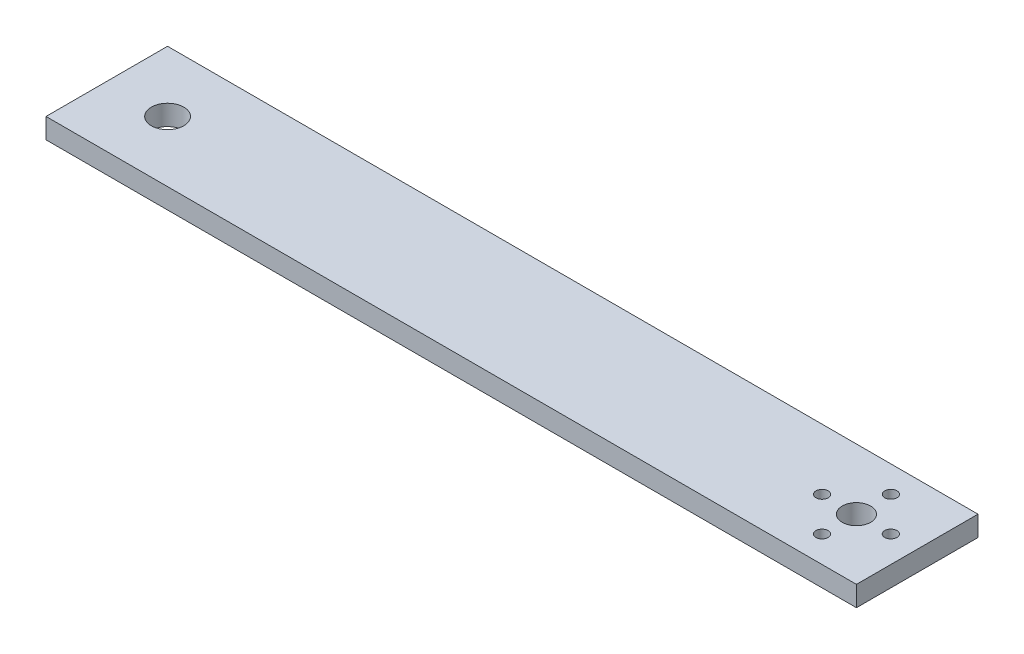
ISO-10303-21;
HEADER;
FILE_DESCRIPTION(('STEP AP214'),'2;1');
FILE_NAME('part.step','',(''),(''),'','','');
FILE_SCHEMA(('AUTOMOTIVE_DESIGN { 1 0 10303 214 1 1 1 1 }'));
ENDSEC;
DATA;
#1=APPLICATION_CONTEXT('core data for automotive mechanical design processes');
#2=APPLICATION_PROTOCOL_DEFINITION('international standard','automotive_design',2000,#1);
#3=PRODUCT_CONTEXT('',#1,'mechanical');
#4=PRODUCT('Part','Part','',(#3));
#5=PRODUCT_RELATED_PRODUCT_CATEGORY('part','',(#4));
#6=PRODUCT_DEFINITION_FORMATION('','',#4);
#7=PRODUCT_DEFINITION_CONTEXT('part definition',#1,'design');
#8=PRODUCT_DEFINITION('design','',#6,#7);
#9=PRODUCT_DEFINITION_SHAPE('','',#8);
#10=(LENGTH_UNIT() NAMED_UNIT(*) SI_UNIT(.MILLI.,.METRE.));
#11=(NAMED_UNIT(*) PLANE_ANGLE_UNIT() SI_UNIT($,.RADIAN.));
#12=(NAMED_UNIT(*) SI_UNIT($,.STERADIAN.) SOLID_ANGLE_UNIT());
#13=UNCERTAINTY_MEASURE_WITH_UNIT(LENGTH_MEASURE(1.E-05),#10,'distance_accuracy_value','');
#14=(GEOMETRIC_REPRESENTATION_CONTEXT(3) GLOBAL_UNCERTAINTY_ASSIGNED_CONTEXT((#13)) GLOBAL_UNIT_ASSIGNED_CONTEXT((#10,
#11,#12)) REPRESENTATION_CONTEXT('',''));
#15=CARTESIAN_POINT('',(0.,0.,0.));
#16=DIRECTION('',(0.,0.,1.));
#17=DIRECTION('',(1.,0.,0.));
#18=AXIS2_PLACEMENT_3D('',#15,#16,#17);
#19=CARTESIAN_POINT('',(0.,5.,0.));
#20=DIRECTION('',(1.,0.,0.));
#21=DIRECTION('',(0.,0.,-1.));
#22=AXIS2_PLACEMENT_3D('',#19,#20,#21);
#23=PLANE('',#22);
#24=DIRECTION('',(0.,0.,1.));
#25=VECTOR('',#24,1.);
#26=CARTESIAN_POINT('',(0.,0.,0.));
#27=LINE('',#26,#25);
#28=CARTESIAN_POINT('',(0.,0.,-30.));
#29=VERTEX_POINT('',#28);
#30=CARTESIAN_POINT('',(0.,0.,0.));
#31=VERTEX_POINT('',#30);
#32=EDGE_CURVE('E94',#29,#31,#27,.T.);
#33=ORIENTED_EDGE('',*,*,#32,.T.);
#34=DIRECTION('',(0.,-1.,0.));
#35=VECTOR('',#34,1.);
#36=CARTESIAN_POINT('',(0.,5.,0.));
#37=LINE('',#36,#35);
#38=CARTESIAN_POINT('',(0.,5.,0.));
#39=VERTEX_POINT('',#38);
#40=EDGE_CURVE('E11',#39,#31,#37,.T.);
#41=ORIENTED_EDGE('',*,*,#40,.F.);
#42=DIRECTION('',(0.,0.,1.));
#43=VECTOR('',#42,1.);
#44=CARTESIAN_POINT('',(0.,5.,0.));
#45=LINE('',#44,#43);
#46=CARTESIAN_POINT('',(0.,5.,-30.));
#47=VERTEX_POINT('',#46);
#48=EDGE_CURVE('E82',#47,#39,#45,.T.);
#49=ORIENTED_EDGE('',*,*,#48,.F.);
#50=DIRECTION('',(0.,-1.,0.));
#51=VECTOR('',#50,1.);
#52=CARTESIAN_POINT('',(0.,5.,-30.));
#53=LINE('',#52,#51);
#54=EDGE_CURVE('E90',#47,#29,#53,.T.);
#55=ORIENTED_EDGE('',*,*,#54,.T.);
#56=EDGE_LOOP('',(#33,#41,#49,#55));
#57=FACE_BOUND('',#56,.T.);
#58=ADVANCED_FACE('F31',(#57),#23,.F.);
#59=CARTESIAN_POINT('',(0.,5.,0.));
#60=DIRECTION('',(0.,0.,-1.));
#61=DIRECTION('',(-1.,0.,0.));
#62=AXIS2_PLACEMENT_3D('',#59,#60,#61);
#63=PLANE('',#62);
#64=DIRECTION('',(1.,0.,0.));
#65=VECTOR('',#64,1.);
#66=CARTESIAN_POINT('',(0.,0.,0.));
#67=LINE('',#66,#65);
#68=CARTESIAN_POINT('',(200.,0.,0.));
#69=VERTEX_POINT('',#68);
#70=EDGE_CURVE('E86',#31,#69,#67,.T.);
#71=ORIENTED_EDGE('',*,*,#70,.T.);
#72=DIRECTION('',(0.,-1.,0.));
#73=VECTOR('',#72,1.);
#74=CARTESIAN_POINT('',(200.,5.,0.));
#75=LINE('',#74,#73);
#76=CARTESIAN_POINT('',(200.,5.,0.));
#77=VERTEX_POINT('',#76);
#78=EDGE_CURVE('E39',#77,#69,#75,.T.);
#79=ORIENTED_EDGE('',*,*,#78,.F.);
#80=DIRECTION('',(1.,0.,0.));
#81=VECTOR('',#80,1.);
#82=CARTESIAN_POINT('',(0.,5.,0.));
#83=LINE('',#82,#81);
#84=EDGE_CURVE('E77',#39,#77,#83,.T.);
#85=ORIENTED_EDGE('',*,*,#84,.F.);
#86=ORIENTED_EDGE('',*,*,#40,.T.);
#87=EDGE_LOOP('',(#71,#79,#85,#86));
#88=FACE_BOUND('',#87,.T.);
#89=ADVANCED_FACE('F85',(#88),#63,.F.);
#90=CARTESIAN_POINT('',(200.,5.,0.));
#91=DIRECTION('',(-1.,0.,0.));
#92=DIRECTION('',(0.,0.,1.));
#93=AXIS2_PLACEMENT_3D('',#90,#91,#92);
#94=PLANE('',#93);
#95=DIRECTION('',(0.,0.,-1.));
#96=VECTOR('',#95,1.);
#97=CARTESIAN_POINT('',(200.,0.,0.));
#98=LINE('',#97,#96);
#99=CARTESIAN_POINT('',(200.,0.,-30.));
#100=VERTEX_POINT('',#99);
#101=EDGE_CURVE('E64',#69,#100,#98,.T.);
#102=ORIENTED_EDGE('',*,*,#101,.T.);
#103=DIRECTION('',(0.,-1.,0.));
#104=VECTOR('',#103,1.);
#105=CARTESIAN_POINT('',(200.,5.,-30.));
#106=LINE('',#105,#104);
#107=CARTESIAN_POINT('',(200.,5.,-30.));
#108=VERTEX_POINT('',#107);
#109=EDGE_CURVE('E87',#108,#100,#106,.T.);
#110=ORIENTED_EDGE('',*,*,#109,.F.);
#111=DIRECTION('',(0.,0.,-1.));
#112=VECTOR('',#111,1.);
#113=CARTESIAN_POINT('',(200.,5.,0.));
#114=LINE('',#113,#112);
#115=EDGE_CURVE('E80',#77,#108,#114,.T.);
#116=ORIENTED_EDGE('',*,*,#115,.F.);
#117=ORIENTED_EDGE('',*,*,#78,.T.);
#118=EDGE_LOOP('',(#102,#110,#116,#117));
#119=FACE_BOUND('',#118,.T.);
#120=ADVANCED_FACE('F88',(#119),#94,.F.);
#121=CARTESIAN_POINT('',(0.,5.,-30.));
#122=DIRECTION('',(0.,0.,1.));
#123=DIRECTION('',(1.,0.,0.));
#124=AXIS2_PLACEMENT_3D('',#121,#122,#123);
#125=PLANE('',#124);
#126=DIRECTION('',(-1.,0.,0.));
#127=VECTOR('',#126,1.);
#128=CARTESIAN_POINT('',(0.,0.,-30.));
#129=LINE('',#128,#127);
#130=EDGE_CURVE('E70',#100,#29,#129,.T.);
#131=ORIENTED_EDGE('',*,*,#130,.T.);
#132=ORIENTED_EDGE('',*,*,#54,.F.);
#133=DIRECTION('',(-1.,0.,0.));
#134=VECTOR('',#133,1.);
#135=CARTESIAN_POINT('',(0.,5.,-30.));
#136=LINE('',#135,#134);
#137=EDGE_CURVE('E47',#108,#47,#136,.T.);
#138=ORIENTED_EDGE('',*,*,#137,.F.);
#139=ORIENTED_EDGE('',*,*,#109,.T.);
#140=EDGE_LOOP('',(#131,#132,#138,#139));
#141=FACE_BOUND('',#140,.T.);
#142=ADVANCED_FACE('F102',(#141),#125,.F.);
#143=CARTESIAN_POINT('',(0.,5.,-30.));
#144=DIRECTION('',(0.,-1.,0.));
#145=DIRECTION('',(0.,0.,-1.));
#146=AXIS2_PLACEMENT_3D('',#143,#144,#145);
#147=PLANE('',#146);
#148=CARTESIAN_POINT('',(185.,5.,-6.49999999999999));
#149=DIRECTION('',(0.,1.,0.));
#150=DIRECTION('',(0.,0.,-1.));
#151=AXIS2_PLACEMENT_3D('',#148,#149,#150);
#152=CIRCLE('',#151,1.5);
#153=CARTESIAN_POINT('',(185.,5.,-7.99999999999999));
#154=VERTEX_POINT('',#153);
#155=EDGE_CURVE('E138',#154,#154,#152,.T.);
#156=ORIENTED_EDGE('',*,*,#155,.F.);
#157=EDGE_LOOP('',(#156));
#158=FACE_BOUND('',#157,.T.);
#159=CARTESIAN_POINT('',(176.520860482877,5.,-15.));
#160=DIRECTION('',(0.,1.,0.));
#161=DIRECTION('',(0.,0.,-1.));
#162=AXIS2_PLACEMENT_3D('',#159,#160,#161);
#163=CIRCLE('',#162,1.5);
#164=CARTESIAN_POINT('',(176.520860482877,5.,-16.5));
#165=VERTEX_POINT('',#164);
#166=EDGE_CURVE('E132',#165,#165,#163,.T.);
#167=ORIENTED_EDGE('',*,*,#166,.F.);
#168=EDGE_LOOP('',(#167));
#169=FACE_BOUND('',#168,.T.);
#170=CARTESIAN_POINT('',(193.479139517123,5.,-15.));
#171=DIRECTION('',(0.,1.,0.));
#172=DIRECTION('',(0.,0.,1.));
#173=AXIS2_PLACEMENT_3D('',#170,#171,#172);
#174=CIRCLE('',#173,1.5);
#175=CARTESIAN_POINT('',(193.479139517123,5.,-13.5));
#176=VERTEX_POINT('',#175);
#177=EDGE_CURVE('E126',#176,#176,#174,.T.);
#178=ORIENTED_EDGE('',*,*,#177,.F.);
#179=EDGE_LOOP('',(#178));
#180=FACE_BOUND('',#179,.T.);
#181=CARTESIAN_POINT('',(185.,5.,-23.5));
#182=DIRECTION('',(0.,1.,0.));
#183=DIRECTION('',(0.,0.,1.));
#184=AXIS2_PLACEMENT_3D('',#181,#182,#183);
#185=CIRCLE('',#184,1.5);
#186=CARTESIAN_POINT('',(185.,5.,-22.));
#187=VERTEX_POINT('',#186);
#188=EDGE_CURVE('E120',#187,#187,#185,.T.);
#189=ORIENTED_EDGE('',*,*,#188,.F.);
#190=EDGE_LOOP('',(#189));
#191=FACE_BOUND('',#190,.T.);
#192=CARTESIAN_POINT('',(185.,5.,-15.));
#193=DIRECTION('',(0.,1.,0.));
#194=DIRECTION('',(0.,0.,1.));
#195=AXIS2_PLACEMENT_3D('',#192,#193,#194);
#196=CIRCLE('',#195,3.49999999999999);
#197=CARTESIAN_POINT('',(185.,5.,-11.5));
#198=VERTEX_POINT('',#197);
#199=EDGE_CURVE('E114',#198,#198,#196,.T.);
#200=ORIENTED_EDGE('',*,*,#199,.F.);
#201=EDGE_LOOP('',(#200));
#202=FACE_BOUND('',#201,.T.);
#203=CARTESIAN_POINT('',(15.,5.,-15.));
#204=DIRECTION('',(0.,1.,0.));
#205=DIRECTION('',(0.,0.,1.));
#206=AXIS2_PLACEMENT_3D('',#203,#204,#205);
#207=CIRCLE('',#206,4.);
#208=CARTESIAN_POINT('',(15.,5.,-11.));
#209=VERTEX_POINT('',#208);
#210=EDGE_CURVE('E108',#209,#209,#207,.T.);
#211=ORIENTED_EDGE('',*,*,#210,.F.);
#212=EDGE_LOOP('',(#211));
#213=FACE_BOUND('',#212,.T.);
#214=ORIENTED_EDGE('',*,*,#48,.T.);
#215=ORIENTED_EDGE('',*,*,#84,.T.);
#216=ORIENTED_EDGE('',*,*,#115,.T.);
#217=ORIENTED_EDGE('',*,*,#137,.T.);
#218=EDGE_LOOP('',(#214,#215,#216,#217));
#219=FACE_BOUND('',#218,.T.);
#220=ADVANCED_FACE('F78',(#158,#169,#180,#191,#202,#213,#219),#147,.F.);
#221=CARTESIAN_POINT('',(0.,0.,-30.));
#222=DIRECTION('',(0.,-1.,0.));
#223=DIRECTION('',(0.,0.,-1.));
#224=AXIS2_PLACEMENT_3D('',#221,#222,#223);
#225=PLANE('',#224);
#226=CARTESIAN_POINT('',(185.,0.,-6.49999999999999));
#227=DIRECTION('',(0.,1.,0.));
#228=DIRECTION('',(0.,0.,-1.));
#229=AXIS2_PLACEMENT_3D('',#226,#227,#228);
#230=CIRCLE('',#229,1.5);
#231=CARTESIAN_POINT('',(185.,0.,-7.99999999999999));
#232=VERTEX_POINT('',#231);
#233=EDGE_CURVE('E135',#232,#232,#230,.T.);
#234=ORIENTED_EDGE('',*,*,#233,.T.);
#235=EDGE_LOOP('',(#234));
#236=FACE_BOUND('',#235,.T.);
#237=CARTESIAN_POINT('',(176.520860482877,0.,-15.));
#238=DIRECTION('',(0.,1.,0.));
#239=DIRECTION('',(0.,0.,-1.));
#240=AXIS2_PLACEMENT_3D('',#237,#238,#239);
#241=CIRCLE('',#240,1.5);
#242=CARTESIAN_POINT('',(176.520860482877,0.,-16.5));
#243=VERTEX_POINT('',#242);
#244=EDGE_CURVE('E129',#243,#243,#241,.T.);
#245=ORIENTED_EDGE('',*,*,#244,.T.);
#246=EDGE_LOOP('',(#245));
#247=FACE_BOUND('',#246,.T.);
#248=CARTESIAN_POINT('',(193.479139517123,0.,-15.));
#249=DIRECTION('',(0.,1.,0.));
#250=DIRECTION('',(0.,0.,1.));
#251=AXIS2_PLACEMENT_3D('',#248,#249,#250);
#252=CIRCLE('',#251,1.5);
#253=CARTESIAN_POINT('',(193.479139517123,0.,-13.5));
#254=VERTEX_POINT('',#253);
#255=EDGE_CURVE('E123',#254,#254,#252,.T.);
#256=ORIENTED_EDGE('',*,*,#255,.T.);
#257=EDGE_LOOP('',(#256));
#258=FACE_BOUND('',#257,.T.);
#259=CARTESIAN_POINT('',(185.,0.,-23.5));
#260=DIRECTION('',(0.,1.,0.));
#261=DIRECTION('',(0.,0.,1.));
#262=AXIS2_PLACEMENT_3D('',#259,#260,#261);
#263=CIRCLE('',#262,1.5);
#264=CARTESIAN_POINT('',(185.,0.,-22.));
#265=VERTEX_POINT('',#264);
#266=EDGE_CURVE('E117',#265,#265,#263,.T.);
#267=ORIENTED_EDGE('',*,*,#266,.T.);
#268=EDGE_LOOP('',(#267));
#269=FACE_BOUND('',#268,.T.);
#270=CARTESIAN_POINT('',(185.,0.,-15.));
#271=DIRECTION('',(0.,1.,0.));
#272=DIRECTION('',(0.,0.,1.));
#273=AXIS2_PLACEMENT_3D('',#270,#271,#272);
#274=CIRCLE('',#273,3.49999999999999);
#275=CARTESIAN_POINT('',(185.,0.,-11.5));
#276=VERTEX_POINT('',#275);
#277=EDGE_CURVE('E111',#276,#276,#274,.T.);
#278=ORIENTED_EDGE('',*,*,#277,.T.);
#279=EDGE_LOOP('',(#278));
#280=FACE_BOUND('',#279,.T.);
#281=CARTESIAN_POINT('',(15.,0.,-15.));
#282=DIRECTION('',(0.,1.,0.));
#283=DIRECTION('',(0.,0.,1.));
#284=AXIS2_PLACEMENT_3D('',#281,#282,#283);
#285=CIRCLE('',#284,4.);
#286=CARTESIAN_POINT('',(15.,0.,-11.));
#287=VERTEX_POINT('',#286);
#288=EDGE_CURVE('E97',#287,#287,#285,.T.);
#289=ORIENTED_EDGE('',*,*,#288,.T.);
#290=EDGE_LOOP('',(#289));
#291=FACE_BOUND('',#290,.T.);
#292=ORIENTED_EDGE('',*,*,#32,.F.);
#293=ORIENTED_EDGE('',*,*,#130,.F.);
#294=ORIENTED_EDGE('',*,*,#101,.F.);
#295=ORIENTED_EDGE('',*,*,#70,.F.);
#296=EDGE_LOOP('',(#292,#293,#294,#295));
#297=FACE_BOUND('',#296,.T.);
#298=ADVANCED_FACE('F105',(#236,#247,#258,#269,#280,#291,#297),#225,.T.);
#299=CARTESIAN_POINT('',(15.,0.,-15.));
#300=DIRECTION('',(0.,1.,0.));
#301=DIRECTION('',(0.,0.,1.));
#302=AXIS2_PLACEMENT_3D('',#299,#300,#301);
#303=CYLINDRICAL_SURFACE('',#302,4.);
#304=ORIENTED_EDGE('',*,*,#288,.F.);
#305=EDGE_LOOP('',(#304));
#306=FACE_BOUND('',#305,.T.);
#307=ORIENTED_EDGE('',*,*,#210,.T.);
#308=EDGE_LOOP('',(#307));
#309=FACE_BOUND('',#308,.T.);
#310=ADVANCED_FACE('F166',(#306,#309),#303,.F.);
#311=CARTESIAN_POINT('',(185.,0.,-15.));
#312=DIRECTION('',(0.,1.,0.));
#313=DIRECTION('',(0.,0.,1.));
#314=AXIS2_PLACEMENT_3D('',#311,#312,#313);
#315=CYLINDRICAL_SURFACE('',#314,3.49999999999999);
#316=ORIENTED_EDGE('',*,*,#277,.F.);
#317=EDGE_LOOP('',(#316));
#318=FACE_BOUND('',#317,.T.);
#319=ORIENTED_EDGE('',*,*,#199,.T.);
#320=EDGE_LOOP('',(#319));
#321=FACE_BOUND('',#320,.T.);
#322=ADVANCED_FACE('F168',(#318,#321),#315,.F.);
#323=CARTESIAN_POINT('',(185.,0.,-23.5));
#324=DIRECTION('',(0.,1.,0.));
#325=DIRECTION('',(0.,0.,1.));
#326=AXIS2_PLACEMENT_3D('',#323,#324,#325);
#327=CYLINDRICAL_SURFACE('',#326,1.5);
#328=ORIENTED_EDGE('',*,*,#266,.F.);
#329=EDGE_LOOP('',(#328));
#330=FACE_BOUND('',#329,.T.);
#331=ORIENTED_EDGE('',*,*,#188,.T.);
#332=EDGE_LOOP('',(#331));
#333=FACE_BOUND('',#332,.T.);
#334=ADVANCED_FACE('F175',(#330,#333),#327,.F.);
#335=CARTESIAN_POINT('',(193.479139517123,0.,-15.));
#336=DIRECTION('',(0.,1.,0.));
#337=DIRECTION('',(0.,0.,1.));
#338=AXIS2_PLACEMENT_3D('',#335,#336,#337);
#339=CYLINDRICAL_SURFACE('',#338,1.5);
#340=ORIENTED_EDGE('',*,*,#255,.F.);
#341=EDGE_LOOP('',(#340));
#342=FACE_BOUND('',#341,.T.);
#343=ORIENTED_EDGE('',*,*,#177,.T.);
#344=EDGE_LOOP('',(#343));
#345=FACE_BOUND('',#344,.T.);
#346=ADVANCED_FACE('F221',(#342,#345),#339,.F.);
#347=CARTESIAN_POINT('',(176.520860482877,0.,-15.));
#348=DIRECTION('',(0.,1.,0.));
#349=DIRECTION('',(0.,0.,1.));
#350=AXIS2_PLACEMENT_3D('',#347,#348,#349);
#351=CYLINDRICAL_SURFACE('',#350,1.5);
#352=ORIENTED_EDGE('',*,*,#244,.F.);
#353=EDGE_LOOP('',(#352));
#354=FACE_BOUND('',#353,.T.);
#355=ORIENTED_EDGE('',*,*,#166,.T.);
#356=EDGE_LOOP('',(#355));
#357=FACE_BOUND('',#356,.T.);
#358=ADVANCED_FACE('F149',(#354,#357),#351,.F.);
#359=CARTESIAN_POINT('',(185.,0.,-6.49999999999999));
#360=DIRECTION('',(0.,1.,0.));
#361=DIRECTION('',(0.,0.,1.));
#362=AXIS2_PLACEMENT_3D('',#359,#360,#361);
#363=CYLINDRICAL_SURFACE('',#362,1.5);
#364=ORIENTED_EDGE('',*,*,#233,.F.);
#365=EDGE_LOOP('',(#364));
#366=FACE_BOUND('',#365,.T.);
#367=ORIENTED_EDGE('',*,*,#155,.T.);
#368=EDGE_LOOP('',(#367));
#369=FACE_BOUND('',#368,.T.);
#370=ADVANCED_FACE('F146',(#366,#369),#363,.F.);
#371=CLOSED_SHELL('',(#58,#89,#120,#142,#220,#298,#310,#322,#334,#346,#358,#370));
#372=MANIFOLD_SOLID_BREP('B2',#371);
#373=ADVANCED_BREP_SHAPE_REPRESENTATION('',(#18,#372),#14);
#374=SHAPE_DEFINITION_REPRESENTATION(#9,#373);
ENDSEC;
END-ISO-10303-21;
